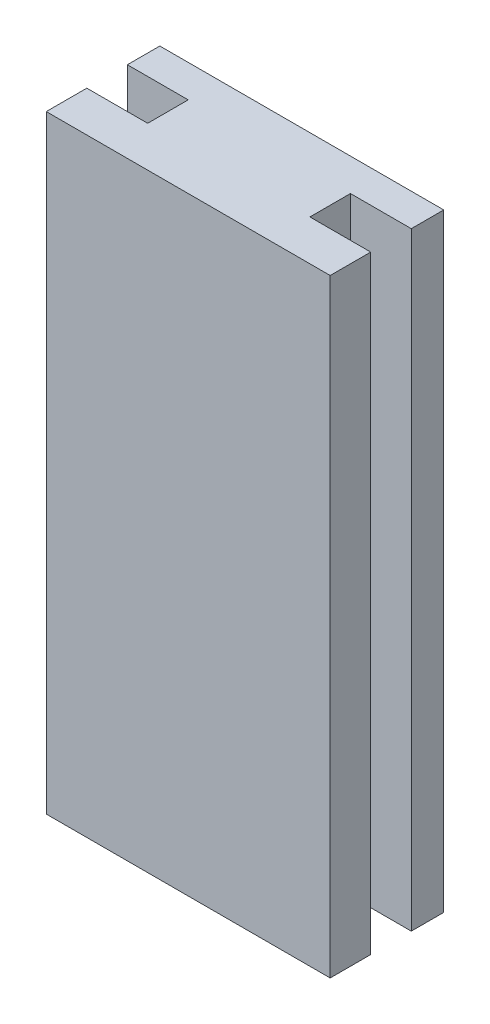
ISO-10303-21;
HEADER;
FILE_DESCRIPTION(('STEP AP214'),'2;1');
FILE_NAME('part.step','',(''),(''),'','','');
FILE_SCHEMA(('AUTOMOTIVE_DESIGN { 1 0 10303 214 1 1 1 1 }'));
ENDSEC;
DATA;
#1=APPLICATION_CONTEXT('core data for automotive mechanical design processes');
#2=APPLICATION_PROTOCOL_DEFINITION('international standard','automotive_design',2000,#1);
#3=PRODUCT_CONTEXT('',#1,'mechanical');
#4=PRODUCT('Part','Part','',(#3));
#5=PRODUCT_RELATED_PRODUCT_CATEGORY('part','',(#4));
#6=PRODUCT_DEFINITION_FORMATION('','',#4);
#7=PRODUCT_DEFINITION_CONTEXT('part definition',#1,'design');
#8=PRODUCT_DEFINITION('design','',#6,#7);
#9=PRODUCT_DEFINITION_SHAPE('','',#8);
#10=(LENGTH_UNIT() NAMED_UNIT(*) SI_UNIT(.MILLI.,.METRE.));
#11=(NAMED_UNIT(*) PLANE_ANGLE_UNIT() SI_UNIT($,.RADIAN.));
#12=(NAMED_UNIT(*) SI_UNIT($,.STERADIAN.) SOLID_ANGLE_UNIT());
#13=UNCERTAINTY_MEASURE_WITH_UNIT(LENGTH_MEASURE(1.E-05),#10,'distance_accuracy_value','');
#14=(GEOMETRIC_REPRESENTATION_CONTEXT(3) GLOBAL_UNCERTAINTY_ASSIGNED_CONTEXT((#13)) GLOBAL_UNIT_ASSIGNED_CONTEXT((#10,
#11,#12)) REPRESENTATION_CONTEXT('',''));
#15=CARTESIAN_POINT('',(0.,0.,0.));
#16=DIRECTION('',(0.,0.,1.));
#17=DIRECTION('',(1.,0.,0.));
#18=AXIS2_PLACEMENT_3D('',#15,#16,#17);
#19=CARTESIAN_POINT('',(0.,150.,-10.));
#20=DIRECTION('',(1.,0.,0.));
#21=DIRECTION('',(0.,0.,-1.));
#22=AXIS2_PLACEMENT_3D('',#19,#20,#21);
#23=PLANE('',#22);
#24=DIRECTION('',(0.,0.,1.));
#25=VECTOR('',#24,1.);
#26=CARTESIAN_POINT('',(0.,0.,-10.));
#27=LINE('',#26,#25);
#28=CARTESIAN_POINT('',(0.,0.,-10.));
#29=VERTEX_POINT('',#28);
#30=CARTESIAN_POINT('',(0.,0.,0.));
#31=VERTEX_POINT('',#30);
#32=EDGE_CURVE('E156',#29,#31,#27,.T.);
#33=ORIENTED_EDGE('',*,*,#32,.T.);
#34=DIRECTION('',(0.,-1.,0.));
#35=VECTOR('',#34,1.);
#36=CARTESIAN_POINT('',(0.,150.,0.));
#37=LINE('',#36,#35);
#38=CARTESIAN_POINT('',(0.,150.,0.));
#39=VERTEX_POINT('',#38);
#40=EDGE_CURVE('E11',#39,#31,#37,.T.);
#41=ORIENTED_EDGE('',*,*,#40,.F.);
#42=DIRECTION('',(0.,0.,1.));
#43=VECTOR('',#42,1.);
#44=CARTESIAN_POINT('',(0.,150.,-10.));
#45=LINE('',#44,#43);
#46=CARTESIAN_POINT('',(0.,150.,-10.));
#47=VERTEX_POINT('',#46);
#48=EDGE_CURVE('E178',#47,#39,#45,.T.);
#49=ORIENTED_EDGE('',*,*,#48,.F.);
#50=DIRECTION('',(0.,-1.,0.));
#51=VECTOR('',#50,1.);
#52=CARTESIAN_POINT('',(0.,150.,-10.));
#53=LINE('',#52,#51);
#54=EDGE_CURVE('E152',#47,#29,#53,.T.);
#55=ORIENTED_EDGE('',*,*,#54,.T.);
#56=EDGE_LOOP('',(#33,#41,#49,#55));
#57=FACE_BOUND('',#56,.T.);
#58=ADVANCED_FACE('F36',(#57),#23,.F.);
#59=CARTESIAN_POINT('',(0.,150.,0.));
#60=DIRECTION('',(0.,0.,-1.));
#61=DIRECTION('',(-1.,0.,0.));
#62=AXIS2_PLACEMENT_3D('',#59,#60,#61);
#63=PLANE('',#62);
#64=DIRECTION('',(1.,0.,0.));
#65=VECTOR('',#64,1.);
#66=CARTESIAN_POINT('',(0.,0.,0.));
#67=LINE('',#66,#65);
#68=CARTESIAN_POINT('',(70.,0.,0.));
#69=VERTEX_POINT('',#68);
#70=EDGE_CURVE('E159',#31,#69,#67,.T.);
#71=ORIENTED_EDGE('',*,*,#70,.T.);
#72=DIRECTION('',(0.,-1.,0.));
#73=VECTOR('',#72,1.);
#74=CARTESIAN_POINT('',(70.,150.,0.));
#75=LINE('',#74,#73);
#76=CARTESIAN_POINT('',(70.,150.,0.));
#77=VERTEX_POINT('',#76);
#78=EDGE_CURVE('E44',#77,#69,#75,.T.);
#79=ORIENTED_EDGE('',*,*,#78,.F.);
#80=DIRECTION('',(1.,0.,0.));
#81=VECTOR('',#80,1.);
#82=CARTESIAN_POINT('',(0.,150.,0.));
#83=LINE('',#82,#81);
#84=EDGE_CURVE('E107',#39,#77,#83,.T.);
#85=ORIENTED_EDGE('',*,*,#84,.F.);
#86=ORIENTED_EDGE('',*,*,#40,.T.);
#87=EDGE_LOOP('',(#71,#79,#85,#86));
#88=FACE_BOUND('',#87,.T.);
#89=ADVANCED_FACE('F256',(#88),#63,.F.);
#90=CARTESIAN_POINT('',(70.,150.,0.));
#91=DIRECTION('',(-1.,0.,0.));
#92=DIRECTION('',(0.,0.,1.));
#93=AXIS2_PLACEMENT_3D('',#90,#91,#92);
#94=PLANE('',#93);
#95=DIRECTION('',(0.,0.,-1.));
#96=VECTOR('',#95,1.);
#97=CARTESIAN_POINT('',(70.,0.,0.));
#98=LINE('',#97,#96);
#99=CARTESIAN_POINT('',(70.,0.,-10.));
#100=VERTEX_POINT('',#99);
#101=EDGE_CURVE('E161',#69,#100,#98,.T.);
#102=ORIENTED_EDGE('',*,*,#101,.T.);
#103=DIRECTION('',(0.,-1.,0.));
#104=VECTOR('',#103,1.);
#105=CARTESIAN_POINT('',(70.,150.,-10.));
#106=LINE('',#105,#104);
#107=CARTESIAN_POINT('',(70.,150.,-10.));
#108=VERTEX_POINT('',#107);
#109=EDGE_CURVE('E197',#108,#100,#106,.T.);
#110=ORIENTED_EDGE('',*,*,#109,.F.);
#111=DIRECTION('',(0.,0.,-1.));
#112=VECTOR('',#111,1.);
#113=CARTESIAN_POINT('',(70.,150.,0.));
#114=LINE('',#113,#112);
#115=EDGE_CURVE('E205',#77,#108,#114,.T.);
#116=ORIENTED_EDGE('',*,*,#115,.F.);
#117=ORIENTED_EDGE('',*,*,#78,.T.);
#118=EDGE_LOOP('',(#102,#110,#116,#117));
#119=FACE_BOUND('',#118,.T.);
#120=ADVANCED_FACE('F203',(#119),#94,.F.);
#121=CARTESIAN_POINT('',(70.,150.,-10.));
#122=DIRECTION('',(0.,0.,1.));
#123=DIRECTION('',(1.,0.,0.));
#124=AXIS2_PLACEMENT_3D('',#121,#122,#123);
#125=PLANE('',#124);
#126=DIRECTION('',(-1.,0.,0.));
#127=VECTOR('',#126,1.);
#128=CARTESIAN_POINT('',(70.,0.,-10.));
#129=LINE('',#128,#127);
#130=CARTESIAN_POINT('',(55.,0.,-10.));
#131=VERTEX_POINT('',#130);
#132=EDGE_CURVE('E163',#100,#131,#129,.T.);
#133=ORIENTED_EDGE('',*,*,#132,.T.);
#134=DIRECTION('',(0.,-1.,0.));
#135=VECTOR('',#134,1.);
#136=CARTESIAN_POINT('',(55.,150.,-10.));
#137=LINE('',#136,#135);
#138=CARTESIAN_POINT('',(55.,150.,-10.));
#139=VERTEX_POINT('',#138);
#140=EDGE_CURVE('E194',#139,#131,#137,.T.);
#141=ORIENTED_EDGE('',*,*,#140,.F.);
#142=DIRECTION('',(-1.,0.,0.));
#143=VECTOR('',#142,1.);
#144=CARTESIAN_POINT('',(70.,150.,-10.));
#145=LINE('',#144,#143);
#146=EDGE_CURVE('E223',#108,#139,#145,.T.);
#147=ORIENTED_EDGE('',*,*,#146,.F.);
#148=ORIENTED_EDGE('',*,*,#109,.T.);
#149=EDGE_LOOP('',(#133,#141,#147,#148));
#150=FACE_BOUND('',#149,.T.);
#151=ADVANCED_FACE('F214',(#150),#125,.F.);
#152=CARTESIAN_POINT('',(55.,150.,-10.));
#153=DIRECTION('',(-1.,0.,0.));
#154=DIRECTION('',(0.,0.,1.));
#155=AXIS2_PLACEMENT_3D('',#152,#153,#154);
#156=PLANE('',#155);
#157=DIRECTION('',(0.,0.,-1.));
#158=VECTOR('',#157,1.);
#159=CARTESIAN_POINT('',(55.,0.,-10.));
#160=LINE('',#159,#158);
#161=CARTESIAN_POINT('',(55.,0.,-20.));
#162=VERTEX_POINT('',#161);
#163=EDGE_CURVE('E165',#131,#162,#160,.T.);
#164=ORIENTED_EDGE('',*,*,#163,.T.);
#165=DIRECTION('',(0.,-1.,0.));
#166=VECTOR('',#165,1.);
#167=CARTESIAN_POINT('',(55.,150.,-20.));
#168=LINE('',#167,#166);
#169=CARTESIAN_POINT('',(55.,150.,-20.));
#170=VERTEX_POINT('',#169);
#171=EDGE_CURVE('E191',#170,#162,#168,.T.);
#172=ORIENTED_EDGE('',*,*,#171,.F.);
#173=DIRECTION('',(0.,0.,-1.));
#174=VECTOR('',#173,1.);
#175=CARTESIAN_POINT('',(55.,150.,-10.));
#176=LINE('',#175,#174);
#177=EDGE_CURVE('E220',#139,#170,#176,.T.);
#178=ORIENTED_EDGE('',*,*,#177,.F.);
#179=ORIENTED_EDGE('',*,*,#140,.T.);
#180=EDGE_LOOP('',(#164,#172,#178,#179));
#181=FACE_BOUND('',#180,.T.);
#182=ADVANCED_FACE('F218',(#181),#156,.F.);
#183=CARTESIAN_POINT('',(55.,150.,-20.));
#184=DIRECTION('',(0.,0.,-1.));
#185=DIRECTION('',(-1.,0.,0.));
#186=AXIS2_PLACEMENT_3D('',#183,#184,#185);
#187=PLANE('',#186);
#188=DIRECTION('',(1.,0.,0.));
#189=VECTOR('',#188,1.);
#190=CARTESIAN_POINT('',(55.,0.,-20.));
#191=LINE('',#190,#189);
#192=CARTESIAN_POINT('',(70.,0.,-20.));
#193=VERTEX_POINT('',#192);
#194=EDGE_CURVE('E167',#162,#193,#191,.T.);
#195=ORIENTED_EDGE('',*,*,#194,.T.);
#196=DIRECTION('',(0.,-1.,0.));
#197=VECTOR('',#196,1.);
#198=CARTESIAN_POINT('',(70.,150.,-20.));
#199=LINE('',#198,#197);
#200=CARTESIAN_POINT('',(70.,150.,-20.));
#201=VERTEX_POINT('',#200);
#202=EDGE_CURVE('E188',#201,#193,#199,.T.);
#203=ORIENTED_EDGE('',*,*,#202,.F.);
#204=DIRECTION('',(1.,0.,0.));
#205=VECTOR('',#204,1.);
#206=CARTESIAN_POINT('',(55.,150.,-20.));
#207=LINE('',#206,#205);
#208=EDGE_CURVE('E222',#170,#201,#207,.T.);
#209=ORIENTED_EDGE('',*,*,#208,.F.);
#210=ORIENTED_EDGE('',*,*,#171,.T.);
#211=EDGE_LOOP('',(#195,#203,#209,#210));
#212=FACE_BOUND('',#211,.T.);
#213=ADVANCED_FACE('F269',(#212),#187,.F.);
#214=CARTESIAN_POINT('',(70.,150.,-20.));
#215=DIRECTION('',(-1.,0.,0.));
#216=DIRECTION('',(0.,0.,1.));
#217=AXIS2_PLACEMENT_3D('',#214,#215,#216);
#218=PLANE('',#217);
#219=DIRECTION('',(0.,0.,-1.));
#220=VECTOR('',#219,1.);
#221=CARTESIAN_POINT('',(70.,0.,-20.));
#222=LINE('',#221,#220);
#223=CARTESIAN_POINT('',(70.,0.,-28.));
#224=VERTEX_POINT('',#223);
#225=EDGE_CURVE('E169',#193,#224,#222,.T.);
#226=ORIENTED_EDGE('',*,*,#225,.T.);
#227=DIRECTION('',(0.,-1.,0.));
#228=VECTOR('',#227,1.);
#229=CARTESIAN_POINT('',(70.,150.,-28.));
#230=LINE('',#229,#228);
#231=CARTESIAN_POINT('',(70.,150.,-28.));
#232=VERTEX_POINT('',#231);
#233=EDGE_CURVE('E185',#232,#224,#230,.T.);
#234=ORIENTED_EDGE('',*,*,#233,.F.);
#235=DIRECTION('',(0.,0.,-1.));
#236=VECTOR('',#235,1.);
#237=CARTESIAN_POINT('',(70.,150.,-20.));
#238=LINE('',#237,#236);
#239=EDGE_CURVE('E225',#201,#232,#238,.T.);
#240=ORIENTED_EDGE('',*,*,#239,.F.);
#241=ORIENTED_EDGE('',*,*,#202,.T.);
#242=EDGE_LOOP('',(#226,#234,#240,#241));
#243=FACE_BOUND('',#242,.T.);
#244=ADVANCED_FACE('F272',(#243),#218,.F.);
#245=CARTESIAN_POINT('',(70.,150.,-28.));
#246=DIRECTION('',(0.,0.,1.));
#247=DIRECTION('',(1.,0.,0.));
#248=AXIS2_PLACEMENT_3D('',#245,#246,#247);
#249=PLANE('',#248);
#250=DIRECTION('',(-1.,0.,0.));
#251=VECTOR('',#250,1.);
#252=CARTESIAN_POINT('',(70.,0.,-28.));
#253=LINE('',#252,#251);
#254=CARTESIAN_POINT('',(0.,0.,-28.));
#255=VERTEX_POINT('',#254);
#256=EDGE_CURVE('E171',#224,#255,#253,.T.);
#257=ORIENTED_EDGE('',*,*,#256,.T.);
#258=DIRECTION('',(0.,-1.,0.));
#259=VECTOR('',#258,1.);
#260=CARTESIAN_POINT('',(0.,150.,-28.));
#261=LINE('',#260,#259);
#262=CARTESIAN_POINT('',(0.,150.,-28.));
#263=VERTEX_POINT('',#262);
#264=EDGE_CURVE('E182',#263,#255,#261,.T.);
#265=ORIENTED_EDGE('',*,*,#264,.F.);
#266=DIRECTION('',(-1.,0.,0.));
#267=VECTOR('',#266,1.);
#268=CARTESIAN_POINT('',(70.,150.,-28.));
#269=LINE('',#268,#267);
#270=EDGE_CURVE('E231',#232,#263,#269,.T.);
#271=ORIENTED_EDGE('',*,*,#270,.F.);
#272=ORIENTED_EDGE('',*,*,#233,.T.);
#273=EDGE_LOOP('',(#257,#265,#271,#272));
#274=FACE_BOUND('',#273,.T.);
#275=ADVANCED_FACE('F237',(#274),#249,.F.);
#276=CARTESIAN_POINT('',(0.,150.,-28.));
#277=DIRECTION('',(1.,0.,0.));
#278=DIRECTION('',(0.,0.,-1.));
#279=AXIS2_PLACEMENT_3D('',#276,#277,#278);
#280=PLANE('',#279);
#281=DIRECTION('',(0.,0.,1.));
#282=VECTOR('',#281,1.);
#283=CARTESIAN_POINT('',(0.,0.,-28.));
#284=LINE('',#283,#282);
#285=CARTESIAN_POINT('',(0.,0.,-20.));
#286=VERTEX_POINT('',#285);
#287=EDGE_CURVE('E173',#255,#286,#284,.T.);
#288=ORIENTED_EDGE('',*,*,#287,.T.);
#289=DIRECTION('',(0.,-1.,0.));
#290=VECTOR('',#289,1.);
#291=CARTESIAN_POINT('',(0.,150.,-20.));
#292=LINE('',#291,#290);
#293=CARTESIAN_POINT('',(0.,150.,-20.));
#294=VERTEX_POINT('',#293);
#295=EDGE_CURVE('E147',#294,#286,#292,.T.);
#296=ORIENTED_EDGE('',*,*,#295,.F.);
#297=DIRECTION('',(0.,0.,1.));
#298=VECTOR('',#297,1.);
#299=CARTESIAN_POINT('',(0.,150.,-28.));
#300=LINE('',#299,#298);
#301=EDGE_CURVE('E138',#263,#294,#300,.T.);
#302=ORIENTED_EDGE('',*,*,#301,.F.);
#303=ORIENTED_EDGE('',*,*,#264,.T.);
#304=EDGE_LOOP('',(#288,#296,#302,#303));
#305=FACE_BOUND('',#304,.T.);
#306=ADVANCED_FACE('F241',(#305),#280,.F.);
#307=CARTESIAN_POINT('',(0.,150.,-20.));
#308=DIRECTION('',(0.,0.,-1.));
#309=DIRECTION('',(-1.,0.,0.));
#310=AXIS2_PLACEMENT_3D('',#307,#308,#309);
#311=PLANE('',#310);
#312=DIRECTION('',(1.,0.,0.));
#313=VECTOR('',#312,1.);
#314=CARTESIAN_POINT('',(0.,0.,-20.));
#315=LINE('',#314,#313);
#316=CARTESIAN_POINT('',(15.,0.,-20.));
#317=VERTEX_POINT('',#316);
#318=EDGE_CURVE('E146',#286,#317,#315,.T.);
#319=ORIENTED_EDGE('',*,*,#318,.T.);
#320=DIRECTION('',(0.,-1.,0.));
#321=VECTOR('',#320,1.);
#322=CARTESIAN_POINT('',(15.,150.,-20.));
#323=LINE('',#322,#321);
#324=CARTESIAN_POINT('',(15.,150.,-20.));
#325=VERTEX_POINT('',#324);
#326=EDGE_CURVE('E143',#325,#317,#323,.T.);
#327=ORIENTED_EDGE('',*,*,#326,.F.);
#328=DIRECTION('',(1.,0.,0.));
#329=VECTOR('',#328,1.);
#330=CARTESIAN_POINT('',(0.,150.,-20.));
#331=LINE('',#330,#329);
#332=EDGE_CURVE('E132',#294,#325,#331,.T.);
#333=ORIENTED_EDGE('',*,*,#332,.F.);
#334=ORIENTED_EDGE('',*,*,#295,.T.);
#335=EDGE_LOOP('',(#319,#327,#333,#334));
#336=FACE_BOUND('',#335,.T.);
#337=ADVANCED_FACE('F144',(#336),#311,.F.);
#338=CARTESIAN_POINT('',(15.,150.,-20.));
#339=DIRECTION('',(1.,0.,0.));
#340=DIRECTION('',(0.,0.,-1.));
#341=AXIS2_PLACEMENT_3D('',#338,#339,#340);
#342=PLANE('',#341);
#343=DIRECTION('',(0.,0.,1.));
#344=VECTOR('',#343,1.);
#345=CARTESIAN_POINT('',(15.,0.,-20.));
#346=LINE('',#345,#344);
#347=CARTESIAN_POINT('',(15.,0.,-10.));
#348=VERTEX_POINT('',#347);
#349=EDGE_CURVE('E93',#317,#348,#346,.T.);
#350=ORIENTED_EDGE('',*,*,#349,.T.);
#351=DIRECTION('',(0.,-1.,0.));
#352=VECTOR('',#351,1.);
#353=CARTESIAN_POINT('',(15.,150.,-10.));
#354=LINE('',#353,#352);
#355=CARTESIAN_POINT('',(15.,150.,-10.));
#356=VERTEX_POINT('',#355);
#357=EDGE_CURVE('E148',#356,#348,#354,.T.);
#358=ORIENTED_EDGE('',*,*,#357,.F.);
#359=DIRECTION('',(0.,0.,1.));
#360=VECTOR('',#359,1.);
#361=CARTESIAN_POINT('',(15.,150.,-20.));
#362=LINE('',#361,#360);
#363=EDGE_CURVE('E136',#325,#356,#362,.T.);
#364=ORIENTED_EDGE('',*,*,#363,.F.);
#365=ORIENTED_EDGE('',*,*,#326,.T.);
#366=EDGE_LOOP('',(#350,#358,#364,#365));
#367=FACE_BOUND('',#366,.T.);
#368=ADVANCED_FACE('F150',(#367),#342,.F.);
#369=CARTESIAN_POINT('',(15.,150.,-10.));
#370=DIRECTION('',(0.,0.,1.));
#371=DIRECTION('',(1.,0.,0.));
#372=AXIS2_PLACEMENT_3D('',#369,#370,#371);
#373=PLANE('',#372);
#374=DIRECTION('',(-1.,0.,0.));
#375=VECTOR('',#374,1.);
#376=CARTESIAN_POINT('',(15.,0.,-10.));
#377=LINE('',#376,#375);
#378=EDGE_CURVE('E99',#348,#29,#377,.T.);
#379=ORIENTED_EDGE('',*,*,#378,.T.);
#380=ORIENTED_EDGE('',*,*,#54,.F.);
#381=DIRECTION('',(-1.,0.,0.));
#382=VECTOR('',#381,1.);
#383=CARTESIAN_POINT('',(15.,150.,-10.));
#384=LINE('',#383,#382);
#385=EDGE_CURVE('E52',#356,#47,#384,.T.);
#386=ORIENTED_EDGE('',*,*,#385,.F.);
#387=ORIENTED_EDGE('',*,*,#357,.T.);
#388=EDGE_LOOP('',(#379,#380,#386,#387));
#389=FACE_BOUND('',#388,.T.);
#390=ADVANCED_FACE('F245',(#389),#373,.F.);
#391=CARTESIAN_POINT('',(0.,150.,0.));
#392=DIRECTION('',(0.,1.,0.));
#393=DIRECTION('',(0.,0.,1.));
#394=AXIS2_PLACEMENT_3D('',#391,#392,#393);
#395=PLANE('',#394);
#396=ORIENTED_EDGE('',*,*,#48,.T.);
#397=ORIENTED_EDGE('',*,*,#84,.T.);
#398=ORIENTED_EDGE('',*,*,#115,.T.);
#399=ORIENTED_EDGE('',*,*,#146,.T.);
#400=ORIENTED_EDGE('',*,*,#177,.T.);
#401=ORIENTED_EDGE('',*,*,#208,.T.);
#402=ORIENTED_EDGE('',*,*,#239,.T.);
#403=ORIENTED_EDGE('',*,*,#270,.T.);
#404=ORIENTED_EDGE('',*,*,#301,.T.);
#405=ORIENTED_EDGE('',*,*,#332,.T.);
#406=ORIENTED_EDGE('',*,*,#363,.T.);
#407=ORIENTED_EDGE('',*,*,#385,.T.);
#408=EDGE_LOOP('',(#396,#397,#398,#399,#400,#401,#402,#403,#404,#405,#406,#407));
#409=FACE_BOUND('',#408,.T.);
#410=ADVANCED_FACE('F134',(#409),#395,.T.);
#411=CARTESIAN_POINT('',(0.,0.,0.));
#412=DIRECTION('',(0.,1.,0.));
#413=DIRECTION('',(0.,0.,1.));
#414=AXIS2_PLACEMENT_3D('',#411,#412,#413);
#415=PLANE('',#414);
#416=ORIENTED_EDGE('',*,*,#32,.F.);
#417=ORIENTED_EDGE('',*,*,#378,.F.);
#418=ORIENTED_EDGE('',*,*,#349,.F.);
#419=ORIENTED_EDGE('',*,*,#318,.F.);
#420=ORIENTED_EDGE('',*,*,#287,.F.);
#421=ORIENTED_EDGE('',*,*,#256,.F.);
#422=ORIENTED_EDGE('',*,*,#225,.F.);
#423=ORIENTED_EDGE('',*,*,#194,.F.);
#424=ORIENTED_EDGE('',*,*,#163,.F.);
#425=ORIENTED_EDGE('',*,*,#132,.F.);
#426=ORIENTED_EDGE('',*,*,#101,.F.);
#427=ORIENTED_EDGE('',*,*,#70,.F.);
#428=EDGE_LOOP('',(#416,#417,#418,#419,#420,#421,#422,#423,#424,#425,#426,#427));
#429=FACE_BOUND('',#428,.T.);
#430=ADVANCED_FACE('F209',(#429),#415,.F.);
#431=CLOSED_SHELL('',(#58,#89,#120,#151,#182,#213,#244,#275,#306,#337,#368,#390,#410,#430));
#432=MANIFOLD_SOLID_BREP('B2',#431);
#433=ADVANCED_BREP_SHAPE_REPRESENTATION('',(#18,#432),#14);
#434=SHAPE_DEFINITION_REPRESENTATION(#9,#433);
ENDSEC;
END-ISO-10303-21;
